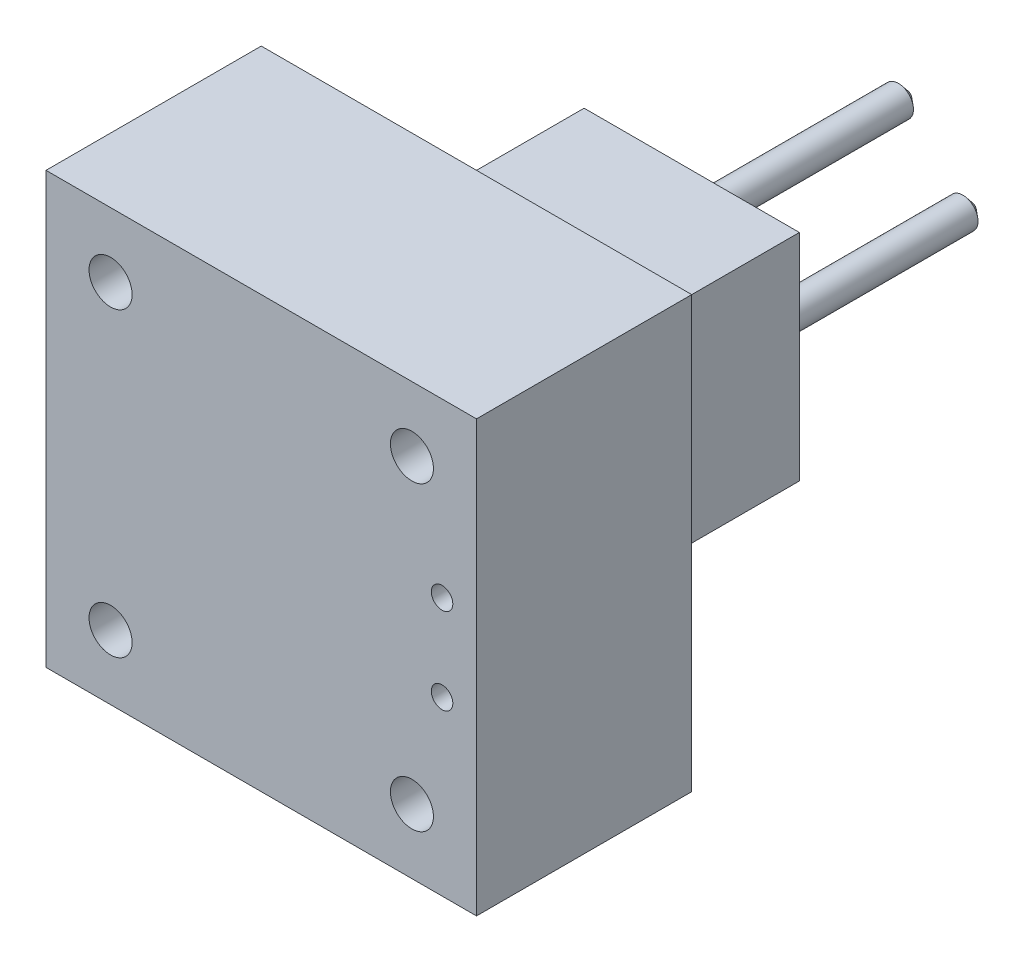
ISO-10303-21;
HEADER;
FILE_DESCRIPTION(('STEP AP214'),'2;1');
FILE_NAME('part.step','',(''),(''),'','','');
FILE_SCHEMA(('AUTOMOTIVE_DESIGN { 1 0 10303 214 1 1 1 1 }'));
ENDSEC;
DATA;
#1=APPLICATION_CONTEXT('core data for automotive mechanical design processes');
#2=APPLICATION_PROTOCOL_DEFINITION('international standard','automotive_design',2000,#1);
#3=PRODUCT_CONTEXT('',#1,'mechanical');
#4=PRODUCT('Part','Part','',(#3));
#5=PRODUCT_RELATED_PRODUCT_CATEGORY('part','',(#4));
#6=PRODUCT_DEFINITION_FORMATION('','',#4);
#7=PRODUCT_DEFINITION_CONTEXT('part definition',#1,'design');
#8=PRODUCT_DEFINITION('design','',#6,#7);
#9=PRODUCT_DEFINITION_SHAPE('','',#8);
#10=(LENGTH_UNIT() NAMED_UNIT(*) SI_UNIT(.MILLI.,.METRE.));
#11=(NAMED_UNIT(*) PLANE_ANGLE_UNIT() SI_UNIT($,.RADIAN.));
#12=(NAMED_UNIT(*) SI_UNIT($,.STERADIAN.) SOLID_ANGLE_UNIT());
#13=UNCERTAINTY_MEASURE_WITH_UNIT(LENGTH_MEASURE(1.E-05),#10,'distance_accuracy_value','');
#14=(GEOMETRIC_REPRESENTATION_CONTEXT(3) GLOBAL_UNCERTAINTY_ASSIGNED_CONTEXT((#13)) GLOBAL_UNIT_ASSIGNED_CONTEXT((#10,
#11,#12)) REPRESENTATION_CONTEXT('',''));
#15=CARTESIAN_POINT('',(0.,0.,0.));
#16=DIRECTION('',(0.,0.,1.));
#17=DIRECTION('',(1.,0.,0.));
#18=AXIS2_PLACEMENT_3D('',#15,#16,#17);
#19=CARTESIAN_POINT('',(0.,0.,0.));
#20=DIRECTION('',(0.,0.,1.));
#21=DIRECTION('',(1.,0.,0.));
#22=AXIS2_PLACEMENT_3D('',#19,#20,#21);
#23=PLANE('',#22);
#24=DIRECTION('',(0.,-1.,0.));
#25=VECTOR('',#24,1.);
#26=CARTESIAN_POINT('',(-46.031746031746,31.2169312169312,0.));
#27=LINE('',#26,#25);
#28=CARTESIAN_POINT('',(-46.031746031746,31.2169312169312,0.));
#29=VERTEX_POINT('',#28);
#30=CARTESIAN_POINT('',(-46.031746031746,-68.7830687830688,0.));
#31=VERTEX_POINT('',#30);
#32=EDGE_CURVE('E183',#29,#31,#27,.T.);
#33=ORIENTED_EDGE('',*,*,#32,.F.);
#34=DIRECTION('',(-1.,0.,0.));
#35=VECTOR('',#34,1.);
#36=CARTESIAN_POINT('',(-46.031746031746,31.2169312169312,0.));
#37=LINE('',#36,#35);
#38=CARTESIAN_POINT('',(53.968253968254,31.2169312169312,0.));
#39=VERTEX_POINT('',#38);
#40=EDGE_CURVE('E192',#39,#29,#37,.T.);
#41=ORIENTED_EDGE('',*,*,#40,.F.);
#42=DIRECTION('',(0.,1.,0.));
#43=VECTOR('',#42,1.);
#44=CARTESIAN_POINT('',(53.968253968254,31.2169312169312,0.));
#45=LINE('',#44,#43);
#46=CARTESIAN_POINT('',(53.968253968254,-68.7830687830688,0.));
#47=VERTEX_POINT('',#46);
#48=EDGE_CURVE('E208',#47,#39,#45,.T.);
#49=ORIENTED_EDGE('',*,*,#48,.F.);
#50=DIRECTION('',(1.,0.,0.));
#51=VECTOR('',#50,1.);
#52=CARTESIAN_POINT('',(-46.031746031746,-68.7830687830688,0.));
#53=LINE('',#52,#51);
#54=EDGE_CURVE('E205',#31,#47,#53,.T.);
#55=ORIENTED_EDGE('',*,*,#54,.F.);
#56=EDGE_LOOP('',(#33,#41,#49,#55));
#57=FACE_BOUND('',#56,.T.);
#58=CARTESIAN_POINT('',(38.968253968254,16.2169312169312,0.));
#59=DIRECTION('',(0.,0.,-1.));
#60=DIRECTION('',(-1.,0.,0.));
#61=AXIS2_PLACEMENT_3D('',#58,#59,#60);
#62=CIRCLE('',#61,5.);
#63=CARTESIAN_POINT('',(33.968253968254,16.2169312169312,0.));
#64=VERTEX_POINT('',#63);
#65=EDGE_CURVE('E167',#64,#64,#62,.T.);
#66=ORIENTED_EDGE('',*,*,#65,.F.);
#67=EDGE_LOOP('',(#66));
#68=FACE_BOUND('',#67,.T.);
#69=CARTESIAN_POINT('',(-31.031746031746,-53.7830687830688,0.));
#70=DIRECTION('',(0.,0.,-1.));
#71=DIRECTION('',(-1.,0.,0.));
#72=AXIS2_PLACEMENT_3D('',#69,#70,#71);
#73=CIRCLE('',#72,5.);
#74=CARTESIAN_POINT('',(-36.031746031746,-53.7830687830688,0.));
#75=VERTEX_POINT('',#74);
#76=EDGE_CURVE('E147',#75,#75,#73,.T.);
#77=ORIENTED_EDGE('',*,*,#76,.F.);
#78=EDGE_LOOP('',(#77));
#79=FACE_BOUND('',#78,.T.);
#80=CARTESIAN_POINT('',(38.968253968254,-53.7830687830688,0.));
#81=DIRECTION('',(0.,0.,-1.));
#82=DIRECTION('',(-1.,0.,0.));
#83=AXIS2_PLACEMENT_3D('',#80,#81,#82);
#84=CIRCLE('',#83,5.);
#85=CARTESIAN_POINT('',(33.968253968254,-53.7830687830688,0.));
#86=VERTEX_POINT('',#85);
#87=EDGE_CURVE('E159',#86,#86,#84,.T.);
#88=ORIENTED_EDGE('',*,*,#87,.F.);
#89=EDGE_LOOP('',(#88));
#90=FACE_BOUND('',#89,.T.);
#91=CARTESIAN_POINT('',(-31.031746031746,16.2169312169312,0.));
#92=DIRECTION('',(0.,0.,-1.));
#93=DIRECTION('',(-1.,0.,0.));
#94=AXIS2_PLACEMENT_3D('',#91,#92,#93);
#95=CIRCLE('',#94,5.);
#96=CARTESIAN_POINT('',(-36.031746031746,16.2169312169312,0.));
#97=VERTEX_POINT('',#96);
#98=EDGE_CURVE('E168',#97,#97,#95,.T.);
#99=ORIENTED_EDGE('',*,*,#98,.F.);
#100=EDGE_LOOP('',(#99));
#101=FACE_BOUND('',#100,.T.);
#102=CARTESIAN_POINT('',(45.968253968254,-28.7830687830688,0.));
#103=DIRECTION('',(0.,0.,-1.));
#104=DIRECTION('',(-1.,0.,0.));
#105=AXIS2_PLACEMENT_3D('',#102,#103,#104);
#106=CIRCLE('',#105,2.5);
#107=CARTESIAN_POINT('',(43.468253968254,-28.7830687830688,0.));
#108=VERTEX_POINT('',#107);
#109=EDGE_CURVE('E132',#108,#108,#106,.T.);
#110=ORIENTED_EDGE('',*,*,#109,.F.);
#111=EDGE_LOOP('',(#110));
#112=FACE_BOUND('',#111,.T.);
#113=CARTESIAN_POINT('',(45.968253968254,-8.78306878306878,0.));
#114=DIRECTION('',(0.,0.,-1.));
#115=DIRECTION('',(-1.,0.,0.));
#116=AXIS2_PLACEMENT_3D('',#113,#114,#115);
#117=CIRCLE('',#116,2.5);
#118=CARTESIAN_POINT('',(43.468253968254,-8.78306878306878,0.));
#119=VERTEX_POINT('',#118);
#120=EDGE_CURVE('E148',#119,#119,#117,.T.);
#121=ORIENTED_EDGE('',*,*,#120,.F.);
#122=EDGE_LOOP('',(#121));
#123=FACE_BOUND('',#122,.T.);
#124=DIRECTION('',(0.,-1.,0.));
#125=VECTOR('',#124,1.);
#126=CARTESIAN_POINT('',(28.968253968254,6.21693121693122,0.));
#127=LINE('',#126,#125);
#128=CARTESIAN_POINT('',(28.968253968254,6.21693121693122,0.));
#129=VERTEX_POINT('',#128);
#130=CARTESIAN_POINT('',(28.968253968254,-43.7830687830688,0.));
#131=VERTEX_POINT('',#130);
#132=EDGE_CURVE('E130',#129,#131,#127,.T.);
#133=ORIENTED_EDGE('',*,*,#132,.F.);
#134=DIRECTION('',(1.,0.,0.));
#135=VECTOR('',#134,1.);
#136=CARTESIAN_POINT('',(28.968253968254,6.21693121693122,0.));
#137=LINE('',#136,#135);
#138=CARTESIAN_POINT('',(-21.031746031746,6.21693121693122,0.));
#139=VERTEX_POINT('',#138);
#140=EDGE_CURVE('E127',#139,#129,#137,.T.);
#141=ORIENTED_EDGE('',*,*,#140,.F.);
#142=DIRECTION('',(0.,1.,0.));
#143=VECTOR('',#142,1.);
#144=CARTESIAN_POINT('',(-21.031746031746,6.21693121693122,0.));
#145=LINE('',#144,#143);
#146=CARTESIAN_POINT('',(-21.031746031746,-43.7830687830688,0.));
#147=VERTEX_POINT('',#146);
#148=EDGE_CURVE('E63',#147,#139,#145,.T.);
#149=ORIENTED_EDGE('',*,*,#148,.F.);
#150=DIRECTION('',(-1.,0.,0.));
#151=VECTOR('',#150,1.);
#152=CARTESIAN_POINT('',(28.968253968254,-43.7830687830688,0.));
#153=LINE('',#152,#151);
#154=EDGE_CURVE('E58',#131,#147,#153,.T.);
#155=ORIENTED_EDGE('',*,*,#154,.F.);
#156=EDGE_LOOP('',(#133,#141,#149,#155));
#157=FACE_BOUND('',#156,.T.);
#158=ADVANCED_FACE('F41',(#57,#68,#79,#90,#101,#112,#123,#157),#23,.F.);
#159=CARTESIAN_POINT('',(-46.031746031746,31.2169312169312,50.));
#160=DIRECTION('',(1.,0.,0.));
#161=DIRECTION('',(0.,1.,0.));
#162=AXIS2_PLACEMENT_3D('',#159,#160,#161);
#163=PLANE('',#162);
#164=ORIENTED_EDGE('',*,*,#32,.T.);
#165=DIRECTION('',(0.,0.,-1.));
#166=VECTOR('',#165,1.);
#167=CARTESIAN_POINT('',(-46.031746031746,-68.7830687830688,50.));
#168=LINE('',#167,#166);
#169=CARTESIAN_POINT('',(-46.031746031746,-68.7830687830688,50.));
#170=VERTEX_POINT('',#169);
#171=EDGE_CURVE('E224',#170,#31,#168,.T.);
#172=ORIENTED_EDGE('',*,*,#171,.F.);
#173=DIRECTION('',(0.,-1.,0.));
#174=VECTOR('',#173,1.);
#175=CARTESIAN_POINT('',(-46.031746031746,31.2169312169312,50.));
#176=LINE('',#175,#174);
#177=CARTESIAN_POINT('',(-46.031746031746,31.2169312169312,50.));
#178=VERTEX_POINT('',#177);
#179=EDGE_CURVE('E187',#178,#170,#176,.T.);
#180=ORIENTED_EDGE('',*,*,#179,.F.);
#181=DIRECTION('',(0.,0.,-1.));
#182=VECTOR('',#181,1.);
#183=CARTESIAN_POINT('',(-46.031746031746,31.2169312169312,50.));
#184=LINE('',#183,#182);
#185=EDGE_CURVE('E201',#178,#29,#184,.T.);
#186=ORIENTED_EDGE('',*,*,#185,.T.);
#187=EDGE_LOOP('',(#164,#172,#180,#186));
#188=FACE_BOUND('',#187,.T.);
#189=ADVANCED_FACE('F283',(#188),#163,.F.);
#190=CARTESIAN_POINT('',(-46.031746031746,-68.7830687830688,50.));
#191=DIRECTION('',(0.,1.,0.));
#192=DIRECTION('',(0.,0.,1.));
#193=AXIS2_PLACEMENT_3D('',#190,#191,#192);
#194=PLANE('',#193);
#195=ORIENTED_EDGE('',*,*,#54,.T.);
#196=DIRECTION('',(0.,0.,-1.));
#197=VECTOR('',#196,1.);
#198=CARTESIAN_POINT('',(53.968253968254,-68.7830687830688,50.));
#199=LINE('',#198,#197);
#200=CARTESIAN_POINT('',(53.968253968254,-68.7830687830688,50.));
#201=VERTEX_POINT('',#200);
#202=EDGE_CURVE('E220',#201,#47,#199,.T.);
#203=ORIENTED_EDGE('',*,*,#202,.F.);
#204=DIRECTION('',(1.,0.,0.));
#205=VECTOR('',#204,1.);
#206=CARTESIAN_POINT('',(-46.031746031746,-68.7830687830688,50.));
#207=LINE('',#206,#205);
#208=EDGE_CURVE('E191',#170,#201,#207,.T.);
#209=ORIENTED_EDGE('',*,*,#208,.F.);
#210=ORIENTED_EDGE('',*,*,#171,.T.);
#211=EDGE_LOOP('',(#195,#203,#209,#210));
#212=FACE_BOUND('',#211,.T.);
#213=ADVANCED_FACE('F289',(#212),#194,.F.);
#214=CARTESIAN_POINT('',(53.968253968254,31.2169312169312,50.));
#215=DIRECTION('',(-1.,0.,0.));
#216=DIRECTION('',(0.,-1.,0.));
#217=AXIS2_PLACEMENT_3D('',#214,#215,#216);
#218=PLANE('',#217);
#219=ORIENTED_EDGE('',*,*,#48,.T.);
#220=DIRECTION('',(0.,0.,-1.));
#221=VECTOR('',#220,1.);
#222=CARTESIAN_POINT('',(53.968253968254,31.2169312169312,50.));
#223=LINE('',#222,#221);
#224=CARTESIAN_POINT('',(53.968253968254,31.2169312169312,50.));
#225=VERTEX_POINT('',#224);
#226=EDGE_CURVE('E216',#225,#39,#223,.T.);
#227=ORIENTED_EDGE('',*,*,#226,.F.);
#228=DIRECTION('',(0.,1.,0.));
#229=VECTOR('',#228,1.);
#230=CARTESIAN_POINT('',(53.968253968254,31.2169312169312,50.));
#231=LINE('',#230,#229);
#232=EDGE_CURVE('E195',#201,#225,#231,.T.);
#233=ORIENTED_EDGE('',*,*,#232,.F.);
#234=ORIENTED_EDGE('',*,*,#202,.T.);
#235=EDGE_LOOP('',(#219,#227,#233,#234));
#236=FACE_BOUND('',#235,.T.);
#237=ADVANCED_FACE('F301',(#236),#218,.F.);
#238=CARTESIAN_POINT('',(-46.031746031746,31.2169312169312,50.));
#239=DIRECTION('',(0.,-1.,0.));
#240=DIRECTION('',(0.,0.,-1.));
#241=AXIS2_PLACEMENT_3D('',#238,#239,#240);
#242=PLANE('',#241);
#243=ORIENTED_EDGE('',*,*,#40,.T.);
#244=ORIENTED_EDGE('',*,*,#185,.F.);
#245=DIRECTION('',(-1.,0.,0.));
#246=VECTOR('',#245,1.);
#247=CARTESIAN_POINT('',(-46.031746031746,31.2169312169312,50.));
#248=LINE('',#247,#246);
#249=EDGE_CURVE('E198',#225,#178,#248,.T.);
#250=ORIENTED_EDGE('',*,*,#249,.F.);
#251=ORIENTED_EDGE('',*,*,#226,.T.);
#252=EDGE_LOOP('',(#243,#244,#250,#251));
#253=FACE_BOUND('',#252,.T.);
#254=ADVANCED_FACE('F298',(#253),#242,.F.);
#255=CARTESIAN_POINT('',(0.,0.,50.));
#256=DIRECTION('',(0.,0.,1.));
#257=DIRECTION('',(1.,0.,0.));
#258=AXIS2_PLACEMENT_3D('',#255,#256,#257);
#259=PLANE('',#258);
#260=CARTESIAN_POINT('',(45.968253968254,-8.78306878306878,50.));
#261=DIRECTION('',(0.,0.,-1.));
#262=DIRECTION('',(-1.,0.,0.));
#263=AXIS2_PLACEMENT_3D('',#260,#261,#262);
#264=CIRCLE('',#263,2.5);
#265=CARTESIAN_POINT('',(43.468253968254,-8.78306878306878,50.));
#266=VERTEX_POINT('',#265);
#267=EDGE_CURVE('E143',#266,#266,#264,.T.);
#268=ORIENTED_EDGE('',*,*,#267,.T.);
#269=EDGE_LOOP('',(#268));
#270=FACE_BOUND('',#269,.T.);
#271=CARTESIAN_POINT('',(45.968253968254,-28.7830687830688,50.));
#272=DIRECTION('',(0.,0.,-1.));
#273=DIRECTION('',(-1.,0.,0.));
#274=AXIS2_PLACEMENT_3D('',#271,#272,#273);
#275=CIRCLE('',#274,2.5);
#276=CARTESIAN_POINT('',(43.468253968254,-28.7830687830688,50.));
#277=VERTEX_POINT('',#276);
#278=EDGE_CURVE('E137',#277,#277,#275,.T.);
#279=ORIENTED_EDGE('',*,*,#278,.T.);
#280=EDGE_LOOP('',(#279));
#281=FACE_BOUND('',#280,.T.);
#282=CARTESIAN_POINT('',(-31.031746031746,16.2169312169312,50.));
#283=DIRECTION('',(0.,0.,-1.));
#284=DIRECTION('',(-1.,0.,0.));
#285=AXIS2_PLACEMENT_3D('',#282,#283,#284);
#286=CIRCLE('',#285,5.);
#287=CARTESIAN_POINT('',(-36.031746031746,16.2169312169312,50.));
#288=VERTEX_POINT('',#287);
#289=EDGE_CURVE('E163',#288,#288,#286,.T.);
#290=ORIENTED_EDGE('',*,*,#289,.T.);
#291=EDGE_LOOP('',(#290));
#292=FACE_BOUND('',#291,.T.);
#293=CARTESIAN_POINT('',(38.968253968254,-53.7830687830688,50.));
#294=DIRECTION('',(0.,0.,-1.));
#295=DIRECTION('',(-1.,0.,0.));
#296=AXIS2_PLACEMENT_3D('',#293,#294,#295);
#297=CIRCLE('',#296,5.);
#298=CARTESIAN_POINT('',(33.968253968254,-53.7830687830688,50.));
#299=VERTEX_POINT('',#298);
#300=EDGE_CURVE('E172',#299,#299,#297,.T.);
#301=ORIENTED_EDGE('',*,*,#300,.T.);
#302=EDGE_LOOP('',(#301));
#303=FACE_BOUND('',#302,.T.);
#304=CARTESIAN_POINT('',(-31.031746031746,-53.7830687830688,50.));
#305=DIRECTION('',(0.,0.,-1.));
#306=DIRECTION('',(-1.,0.,0.));
#307=AXIS2_PLACEMENT_3D('',#304,#305,#306);
#308=CIRCLE('',#307,5.);
#309=CARTESIAN_POINT('',(-36.031746031746,-53.7830687830688,50.));
#310=VERTEX_POINT('',#309);
#311=EDGE_CURVE('E155',#310,#310,#308,.T.);
#312=ORIENTED_EDGE('',*,*,#311,.T.);
#313=EDGE_LOOP('',(#312));
#314=FACE_BOUND('',#313,.T.);
#315=CARTESIAN_POINT('',(38.968253968254,16.2169312169312,50.));
#316=DIRECTION('',(0.,0.,-1.));
#317=DIRECTION('',(-1.,0.,0.));
#318=AXIS2_PLACEMENT_3D('',#315,#316,#317);
#319=CIRCLE('',#318,5.);
#320=CARTESIAN_POINT('',(33.968253968254,16.2169312169312,50.));
#321=VERTEX_POINT('',#320);
#322=EDGE_CURVE('E179',#321,#321,#319,.T.);
#323=ORIENTED_EDGE('',*,*,#322,.T.);
#324=EDGE_LOOP('',(#323));
#325=FACE_BOUND('',#324,.T.);
#326=ORIENTED_EDGE('',*,*,#179,.T.);
#327=ORIENTED_EDGE('',*,*,#208,.T.);
#328=ORIENTED_EDGE('',*,*,#232,.T.);
#329=ORIENTED_EDGE('',*,*,#249,.T.);
#330=EDGE_LOOP('',(#326,#327,#328,#329));
#331=FACE_BOUND('',#330,.T.);
#332=ADVANCED_FACE('F296',(#270,#281,#292,#303,#314,#325,#331),#259,.T.);
#333=CARTESIAN_POINT('',(38.968253968254,16.2169312169312,50.));
#334=DIRECTION('',(0.,0.,-1.));
#335=DIRECTION('',(-1.,0.,0.));
#336=AXIS2_PLACEMENT_3D('',#333,#334,#335);
#337=CYLINDRICAL_SURFACE('',#336,5.);
#338=ORIENTED_EDGE('',*,*,#322,.F.);
#339=EDGE_LOOP('',(#338));
#340=FACE_BOUND('',#339,.T.);
#341=ORIENTED_EDGE('',*,*,#65,.T.);
#342=EDGE_LOOP('',(#341));
#343=FACE_BOUND('',#342,.T.);
#344=ADVANCED_FACE('F392',(#340,#343),#337,.F.);
#345=CARTESIAN_POINT('',(-31.031746031746,-53.7830687830688,50.));
#346=DIRECTION('',(0.,0.,-1.));
#347=DIRECTION('',(-1.,0.,0.));
#348=AXIS2_PLACEMENT_3D('',#345,#346,#347);
#349=CYLINDRICAL_SURFACE('',#348,5.);
#350=ORIENTED_EDGE('',*,*,#311,.F.);
#351=EDGE_LOOP('',(#350));
#352=FACE_BOUND('',#351,.T.);
#353=ORIENTED_EDGE('',*,*,#76,.T.);
#354=EDGE_LOOP('',(#353));
#355=FACE_BOUND('',#354,.T.);
#356=ADVANCED_FACE('F388',(#352,#355),#349,.F.);
#357=CARTESIAN_POINT('',(38.968253968254,-53.7830687830688,50.));
#358=DIRECTION('',(0.,0.,-1.));
#359=DIRECTION('',(-1.,0.,0.));
#360=AXIS2_PLACEMENT_3D('',#357,#358,#359);
#361=CYLINDRICAL_SURFACE('',#360,5.);
#362=ORIENTED_EDGE('',*,*,#300,.F.);
#363=EDGE_LOOP('',(#362));
#364=FACE_BOUND('',#363,.T.);
#365=ORIENTED_EDGE('',*,*,#87,.T.);
#366=EDGE_LOOP('',(#365));
#367=FACE_BOUND('',#366,.T.);
#368=ADVANCED_FACE('F391',(#364,#367),#361,.F.);
#369=CARTESIAN_POINT('',(-31.031746031746,16.2169312169312,50.));
#370=DIRECTION('',(0.,0.,-1.));
#371=DIRECTION('',(-1.,0.,0.));
#372=AXIS2_PLACEMENT_3D('',#369,#370,#371);
#373=CYLINDRICAL_SURFACE('',#372,5.);
#374=ORIENTED_EDGE('',*,*,#289,.F.);
#375=EDGE_LOOP('',(#374));
#376=FACE_BOUND('',#375,.T.);
#377=ORIENTED_EDGE('',*,*,#98,.T.);
#378=EDGE_LOOP('',(#377));
#379=FACE_BOUND('',#378,.T.);
#380=ADVANCED_FACE('F386',(#376,#379),#373,.F.);
#381=CARTESIAN_POINT('',(45.968253968254,-28.7830687830688,50.));
#382=DIRECTION('',(0.,0.,-1.));
#383=DIRECTION('',(-1.,0.,0.));
#384=AXIS2_PLACEMENT_3D('',#381,#382,#383);
#385=CYLINDRICAL_SURFACE('',#384,2.5);
#386=ORIENTED_EDGE('',*,*,#278,.F.);
#387=EDGE_LOOP('',(#386));
#388=FACE_BOUND('',#387,.T.);
#389=ORIENTED_EDGE('',*,*,#109,.T.);
#390=EDGE_LOOP('',(#389));
#391=FACE_BOUND('',#390,.T.);
#392=ADVANCED_FACE('F382',(#388,#391),#385,.F.);
#393=CARTESIAN_POINT('',(45.968253968254,-8.78306878306878,50.));
#394=DIRECTION('',(0.,0.,-1.));
#395=DIRECTION('',(-1.,0.,0.));
#396=AXIS2_PLACEMENT_3D('',#393,#394,#395);
#397=CYLINDRICAL_SURFACE('',#396,2.5);
#398=ORIENTED_EDGE('',*,*,#267,.F.);
#399=EDGE_LOOP('',(#398));
#400=FACE_BOUND('',#399,.T.);
#401=ORIENTED_EDGE('',*,*,#120,.T.);
#402=EDGE_LOOP('',(#401));
#403=FACE_BOUND('',#402,.T.);
#404=ADVANCED_FACE('F379',(#400,#403),#397,.F.);
#405=CARTESIAN_POINT('',(28.968253968254,6.21693121693122,-50.));
#406=DIRECTION('',(-1.,0.,0.));
#407=DIRECTION('',(0.,-1.,0.));
#408=AXIS2_PLACEMENT_3D('',#405,#406,#407);
#409=PLANE('',#408);
#410=ORIENTED_EDGE('',*,*,#132,.T.);
#411=DIRECTION('',(0.,0.,1.));
#412=VECTOR('',#411,1.);
#413=CARTESIAN_POINT('',(28.968253968254,-43.7830687830688,-50.));
#414=LINE('',#413,#412);
#415=CARTESIAN_POINT('',(28.968253968254,-43.7830687830688,-50.));
#416=VERTEX_POINT('',#415);
#417=EDGE_CURVE('E109',#416,#131,#414,.T.);
#418=ORIENTED_EDGE('',*,*,#417,.F.);
#419=DIRECTION('',(0.,-1.,0.));
#420=VECTOR('',#419,1.);
#421=CARTESIAN_POINT('',(28.968253968254,6.21693121693122,-50.));
#422=LINE('',#421,#420);
#423=CARTESIAN_POINT('',(28.968253968254,6.21693121693122,-50.));
#424=VERTEX_POINT('',#423);
#425=EDGE_CURVE('E117',#424,#416,#422,.T.);
#426=ORIENTED_EDGE('',*,*,#425,.F.);
#427=DIRECTION('',(0.,0.,1.));
#428=VECTOR('',#427,1.);
#429=CARTESIAN_POINT('',(28.968253968254,6.21693121693122,-50.));
#430=LINE('',#429,#428);
#431=EDGE_CURVE('E422',#424,#129,#430,.T.);
#432=ORIENTED_EDGE('',*,*,#431,.T.);
#433=EDGE_LOOP('',(#410,#418,#426,#432));
#434=FACE_BOUND('',#433,.T.);
#435=ADVANCED_FACE('F129',(#434),#409,.F.);
#436=CARTESIAN_POINT('',(28.968253968254,-43.7830687830688,-50.));
#437=DIRECTION('',(0.,1.,0.));
#438=DIRECTION('',(0.,0.,1.));
#439=AXIS2_PLACEMENT_3D('',#436,#437,#438);
#440=PLANE('',#439);
#441=ORIENTED_EDGE('',*,*,#154,.T.);
#442=DIRECTION('',(0.,0.,1.));
#443=VECTOR('',#442,1.);
#444=CARTESIAN_POINT('',(-21.031746031746,-43.7830687830688,-50.));
#445=LINE('',#444,#443);
#446=CARTESIAN_POINT('',(-21.031746031746,-43.7830687830688,-50.));
#447=VERTEX_POINT('',#446);
#448=EDGE_CURVE('E112',#447,#147,#445,.T.);
#449=ORIENTED_EDGE('',*,*,#448,.F.);
#450=DIRECTION('',(-1.,0.,0.));
#451=VECTOR('',#450,1.);
#452=CARTESIAN_POINT('',(28.968253968254,-43.7830687830688,-50.));
#453=LINE('',#452,#451);
#454=EDGE_CURVE('E105',#416,#447,#453,.T.);
#455=ORIENTED_EDGE('',*,*,#454,.F.);
#456=ORIENTED_EDGE('',*,*,#417,.T.);
#457=EDGE_LOOP('',(#441,#449,#455,#456));
#458=FACE_BOUND('',#457,.T.);
#459=ADVANCED_FACE('F107',(#458),#440,.F.);
#460=CARTESIAN_POINT('',(-21.031746031746,6.21693121693122,-50.));
#461=DIRECTION('',(1.,0.,0.));
#462=DIRECTION('',(0.,1.,0.));
#463=AXIS2_PLACEMENT_3D('',#460,#461,#462);
#464=PLANE('',#463);
#465=ORIENTED_EDGE('',*,*,#148,.T.);
#466=DIRECTION('',(0.,0.,1.));
#467=VECTOR('',#466,1.);
#468=CARTESIAN_POINT('',(-21.031746031746,6.21693121693122,-50.));
#469=LINE('',#468,#467);
#470=CARTESIAN_POINT('',(-21.031746031746,6.21693121693122,-50.));
#471=VERTEX_POINT('',#470);
#472=EDGE_CURVE('E139',#471,#139,#469,.T.);
#473=ORIENTED_EDGE('',*,*,#472,.F.);
#474=DIRECTION('',(0.,1.,0.));
#475=VECTOR('',#474,1.);
#476=CARTESIAN_POINT('',(-21.031746031746,6.21693121693122,-50.));
#477=LINE('',#476,#475);
#478=EDGE_CURVE('E116',#447,#471,#477,.T.);
#479=ORIENTED_EDGE('',*,*,#478,.F.);
#480=ORIENTED_EDGE('',*,*,#448,.T.);
#481=EDGE_LOOP('',(#465,#473,#479,#480));
#482=FACE_BOUND('',#481,.T.);
#483=ADVANCED_FACE('F370',(#482),#464,.F.);
#484=CARTESIAN_POINT('',(28.968253968254,6.21693121693122,-50.));
#485=DIRECTION('',(0.,-1.,0.));
#486=DIRECTION('',(0.,0.,-1.));
#487=AXIS2_PLACEMENT_3D('',#484,#485,#486);
#488=PLANE('',#487);
#489=ORIENTED_EDGE('',*,*,#140,.T.);
#490=ORIENTED_EDGE('',*,*,#431,.F.);
#491=DIRECTION('',(1.,0.,0.));
#492=VECTOR('',#491,1.);
#493=CARTESIAN_POINT('',(28.968253968254,6.21693121693122,-50.));
#494=LINE('',#493,#492);
#495=EDGE_CURVE('E122',#471,#424,#494,.T.);
#496=ORIENTED_EDGE('',*,*,#495,.F.);
#497=ORIENTED_EDGE('',*,*,#472,.T.);
#498=EDGE_LOOP('',(#489,#490,#496,#497));
#499=FACE_BOUND('',#498,.T.);
#500=ADVANCED_FACE('F366',(#499),#488,.F.);
#501=CARTESIAN_POINT('',(0.,0.,-50.));
#502=DIRECTION('',(0.,0.,-1.));
#503=DIRECTION('',(-1.,0.,0.));
#504=AXIS2_PLACEMENT_3D('',#501,#502,#503);
#505=PLANE('',#504);
#506=CARTESIAN_POINT('',(-11.031746031746,-18.7830687830688,-50.));
#507=DIRECTION('',(0.,0.,-1.));
#508=DIRECTION('',(-1.,0.,0.));
#509=AXIS2_PLACEMENT_3D('',#506,#507,#508);
#510=CIRCLE('',#509,3.5);
#511=CARTESIAN_POINT('',(-14.531746031746,-18.7830687830688,-50.));
#512=VERTEX_POINT('',#511);
#513=EDGE_CURVE('E241',#512,#512,#510,.F.);
#514=ORIENTED_EDGE('',*,*,#513,.T.);
#515=EDGE_LOOP('',(#514));
#516=FACE_BOUND('',#515,.T.);
#517=CARTESIAN_POINT('',(3.96825396825399,-33.7830687830688,-50.));
#518=DIRECTION('',(0.,0.,-1.));
#519=DIRECTION('',(-1.,0.,0.));
#520=AXIS2_PLACEMENT_3D('',#517,#518,#519);
#521=CIRCLE('',#520,3.5);
#522=CARTESIAN_POINT('',(0.468253968253989,-33.7830687830688,-50.));
#523=VERTEX_POINT('',#522);
#524=EDGE_CURVE('E237',#523,#523,#521,.F.);
#525=ORIENTED_EDGE('',*,*,#524,.T.);
#526=EDGE_LOOP('',(#525));
#527=FACE_BOUND('',#526,.T.);
#528=CARTESIAN_POINT('',(18.968253968254,-18.7830687830688,-50.));
#529=DIRECTION('',(0.,0.,-1.));
#530=DIRECTION('',(-1.,0.,0.));
#531=AXIS2_PLACEMENT_3D('',#528,#529,#530);
#532=CIRCLE('',#531,3.5);
#533=CARTESIAN_POINT('',(15.468253968254,-18.7830687830688,-50.));
#534=VERTEX_POINT('',#533);
#535=EDGE_CURVE('E233',#534,#534,#532,.F.);
#536=ORIENTED_EDGE('',*,*,#535,.T.);
#537=EDGE_LOOP('',(#536));
#538=FACE_BOUND('',#537,.T.);
#539=CARTESIAN_POINT('',(3.96825396825399,-3.78306878306878,-50.));
#540=DIRECTION('',(0.,0.,-1.));
#541=DIRECTION('',(-1.,0.,0.));
#542=AXIS2_PLACEMENT_3D('',#539,#540,#541);
#543=CIRCLE('',#542,3.5);
#544=CARTESIAN_POINT('',(0.468253968253989,-3.78306878306878,-50.));
#545=VERTEX_POINT('',#544);
#546=EDGE_CURVE('E229',#545,#545,#543,.F.);
#547=ORIENTED_EDGE('',*,*,#546,.T.);
#548=EDGE_LOOP('',(#547));
#549=FACE_BOUND('',#548,.T.);
#550=ORIENTED_EDGE('',*,*,#425,.T.);
#551=ORIENTED_EDGE('',*,*,#454,.T.);
#552=ORIENTED_EDGE('',*,*,#478,.T.);
#553=ORIENTED_EDGE('',*,*,#495,.T.);
#554=EDGE_LOOP('',(#550,#551,#552,#553));
#555=FACE_BOUND('',#554,.T.);
#556=ADVANCED_FACE('F120',(#516,#527,#538,#549,#555),#505,.T.);
#557=CARTESIAN_POINT('',(3.96825396825399,-3.78306878306878,-100.));
#558=DIRECTION('',(0.,0.,1.));
#559=DIRECTION('',(1.,0.,0.));
#560=AXIS2_PLACEMENT_3D('',#557,#558,#559);
#561=CYLINDRICAL_SURFACE('',#560,3.5);
#562=CARTESIAN_POINT('',(3.96825396825399,-3.78306878306878,-98.));
#563=DIRECTION('',(0.,0.,-1.));
#564=DIRECTION('',(-1.,0.,0.));
#565=AXIS2_PLACEMENT_3D('',#562,#563,#564);
#566=CIRCLE('',#565,3.5);
#567=CARTESIAN_POINT('',(0.468253968253989,-3.78306878306878,-98.));
#568=VERTEX_POINT('',#567);
#569=EDGE_CURVE('E248',#568,#568,#566,.F.);
#570=ORIENTED_EDGE('',*,*,#569,.T.);
#571=EDGE_LOOP('',(#570));
#572=FACE_BOUND('',#571,.T.);
#573=ORIENTED_EDGE('',*,*,#546,.F.);
#574=EDGE_LOOP('',(#573));
#575=FACE_BOUND('',#574,.T.);
#576=ADVANCED_FACE('F359',(#572,#575),#561,.T.);
#577=CARTESIAN_POINT('',(3.96825396825399,-3.78306878306878,-100.));
#578=DIRECTION('',(0.,0.,-1.));
#579=DIRECTION('',(-1.,0.,0.));
#580=AXIS2_PLACEMENT_3D('',#577,#578,#579);
#581=PLANE('',#580);
#582=CARTESIAN_POINT('',(3.96825396825399,-3.78306878306878,-100.));
#583=DIRECTION('',(0.,0.,-1.));
#584=DIRECTION('',(-1.,0.,0.));
#585=AXIS2_PLACEMENT_3D('',#582,#583,#584);
#586=CIRCLE('',#585,1.11649281481158);
#587=CARTESIAN_POINT('',(2.85176115344241,-3.78306878306878,-100.));
#588=VERTEX_POINT('',#587);
#589=EDGE_CURVE('E228',#588,#588,#586,.T.);
#590=ORIENTED_EDGE('',*,*,#589,.T.);
#591=EDGE_LOOP('',(#590));
#592=FACE_BOUND('',#591,.T.);
#593=ADVANCED_FACE('F355',(#592),#581,.T.);
#594=CARTESIAN_POINT('',(18.968253968254,-18.7830687830688,-100.));
#595=DIRECTION('',(0.,0.,1.));
#596=DIRECTION('',(1.,0.,0.));
#597=AXIS2_PLACEMENT_3D('',#594,#595,#596);
#598=CYLINDRICAL_SURFACE('',#597,3.5);
#599=CARTESIAN_POINT('',(18.968253968254,-18.7830687830688,-98.));
#600=DIRECTION('',(0.,0.,-1.));
#601=DIRECTION('',(-1.,0.,0.));
#602=AXIS2_PLACEMENT_3D('',#599,#600,#601);
#603=CIRCLE('',#602,3.5);
#604=CARTESIAN_POINT('',(15.468253968254,-18.7830687830688,-98.));
#605=VERTEX_POINT('',#604);
#606=EDGE_CURVE('E11',#605,#605,#603,.F.);
#607=ORIENTED_EDGE('',*,*,#606,.T.);
#608=EDGE_LOOP('',(#607));
#609=FACE_BOUND('',#608,.T.);
#610=ORIENTED_EDGE('',*,*,#535,.F.);
#611=EDGE_LOOP('',(#610));
#612=FACE_BOUND('',#611,.T.);
#613=ADVANCED_FACE('F352',(#609,#612),#598,.T.);
#614=CARTESIAN_POINT('',(18.968253968254,-18.7830687830688,-100.));
#615=DIRECTION('',(0.,0.,-1.));
#616=DIRECTION('',(-1.,0.,0.));
#617=AXIS2_PLACEMENT_3D('',#614,#615,#616);
#618=PLANE('',#617);
#619=CARTESIAN_POINT('',(18.968253968254,-18.7830687830688,-100.));
#620=DIRECTION('',(0.,0.,-1.));
#621=DIRECTION('',(-1.,0.,0.));
#622=AXIS2_PLACEMENT_3D('',#619,#620,#621);
#623=CIRCLE('',#622,1.11649281481155);
#624=CARTESIAN_POINT('',(17.8517611534424,-18.7830687830688,-100.));
#625=VERTEX_POINT('',#624);
#626=EDGE_CURVE('E51',#625,#625,#623,.T.);
#627=ORIENTED_EDGE('',*,*,#626,.T.);
#628=EDGE_LOOP('',(#627));
#629=FACE_BOUND('',#628,.T.);
#630=ADVANCED_FACE('F271',(#629),#618,.T.);
#631=CARTESIAN_POINT('',(3.96825396825399,-33.7830687830688,-100.));
#632=DIRECTION('',(0.,0.,1.));
#633=DIRECTION('',(1.,0.,0.));
#634=AXIS2_PLACEMENT_3D('',#631,#632,#633);
#635=CYLINDRICAL_SURFACE('',#634,3.5);
#636=CARTESIAN_POINT('',(3.96825396825399,-33.7830687830688,-98.));
#637=DIRECTION('',(0.,0.,-1.));
#638=DIRECTION('',(-1.,0.,0.));
#639=AXIS2_PLACEMENT_3D('',#636,#637,#638);
#640=CIRCLE('',#639,3.5);
#641=CARTESIAN_POINT('',(0.468253968253989,-33.7830687830688,-98.));
#642=VERTEX_POINT('',#641);
#643=EDGE_CURVE('E264',#642,#642,#640,.F.);
#644=ORIENTED_EDGE('',*,*,#643,.T.);
#645=EDGE_LOOP('',(#644));
#646=FACE_BOUND('',#645,.T.);
#647=ORIENTED_EDGE('',*,*,#524,.F.);
#648=EDGE_LOOP('',(#647));
#649=FACE_BOUND('',#648,.T.);
#650=ADVANCED_FACE('F345',(#646,#649),#635,.T.);
#651=CARTESIAN_POINT('',(3.96825396825399,-33.7830687830688,-100.));
#652=DIRECTION('',(0.,0.,-1.));
#653=DIRECTION('',(-1.,0.,0.));
#654=AXIS2_PLACEMENT_3D('',#651,#652,#653);
#655=PLANE('',#654);
#656=CARTESIAN_POINT('',(3.96825396825399,-33.7830687830688,-100.));
#657=DIRECTION('',(0.,0.,-1.));
#658=DIRECTION('',(-1.,0.,0.));
#659=AXIS2_PLACEMENT_3D('',#656,#657,#658);
#660=CIRCLE('',#659,1.11649281481158);
#661=CARTESIAN_POINT('',(2.85176115344241,-33.7830687830688,-100.));
#662=VERTEX_POINT('',#661);
#663=EDGE_CURVE('E260',#662,#662,#660,.T.);
#664=ORIENTED_EDGE('',*,*,#663,.T.);
#665=EDGE_LOOP('',(#664));
#666=FACE_BOUND('',#665,.T.);
#667=ADVANCED_FACE('F339',(#666),#655,.T.);
#668=CARTESIAN_POINT('',(-11.031746031746,-18.7830687830688,-100.));
#669=DIRECTION('',(0.,0.,1.));
#670=DIRECTION('',(1.,0.,0.));
#671=AXIS2_PLACEMENT_3D('',#668,#669,#670);
#672=CYLINDRICAL_SURFACE('',#671,3.5);
#673=CARTESIAN_POINT('',(-11.031746031746,-18.7830687830688,-98.));
#674=DIRECTION('',(0.,0.,-1.));
#675=DIRECTION('',(-1.,0.,0.));
#676=AXIS2_PLACEMENT_3D('',#673,#674,#675);
#677=CIRCLE('',#676,3.5);
#678=CARTESIAN_POINT('',(-14.531746031746,-18.7830687830688,-98.));
#679=VERTEX_POINT('',#678);
#680=EDGE_CURVE('E256',#679,#679,#677,.F.);
#681=ORIENTED_EDGE('',*,*,#680,.T.);
#682=EDGE_LOOP('',(#681));
#683=FACE_BOUND('',#682,.T.);
#684=ORIENTED_EDGE('',*,*,#513,.F.);
#685=EDGE_LOOP('',(#684));
#686=FACE_BOUND('',#685,.T.);
#687=ADVANCED_FACE('F334',(#683,#686),#672,.T.);
#688=CARTESIAN_POINT('',(-11.031746031746,-18.7830687830688,-100.));
#689=DIRECTION('',(0.,0.,-1.));
#690=DIRECTION('',(-1.,0.,0.));
#691=AXIS2_PLACEMENT_3D('',#688,#689,#690);
#692=PLANE('',#691);
#693=CARTESIAN_POINT('',(-11.031746031746,-18.7830687830688,-100.));
#694=DIRECTION('',(0.,0.,-1.));
#695=DIRECTION('',(-1.,0.,0.));
#696=AXIS2_PLACEMENT_3D('',#693,#694,#695);
#697=CIRCLE('',#696,1.11649281481155);
#698=CARTESIAN_POINT('',(-12.1482388465576,-18.7830687830688,-100.));
#699=VERTEX_POINT('',#698);
#700=EDGE_CURVE('E252',#699,#699,#697,.T.);
#701=ORIENTED_EDGE('',*,*,#700,.T.);
#702=EDGE_LOOP('',(#701));
#703=FACE_BOUND('',#702,.T.);
#704=ADVANCED_FACE('F316',(#703),#692,.T.);
#705=CARTESIAN_POINT('',(3.96825396825399,-3.78306878306878,-100.));
#706=DIRECTION('',(0.,0.,1.));
#707=DIRECTION('',(1.,0.,0.));
#708=AXIS2_PLACEMENT_3D('',#705,#706,#707);
#709=CONICAL_SURFACE('',#708,1.11649281481158,0.872664625997162);
#710=ORIENTED_EDGE('',*,*,#569,.F.);
#711=EDGE_LOOP('',(#710));
#712=FACE_BOUND('',#711,.T.);
#713=ORIENTED_EDGE('',*,*,#589,.F.);
#714=EDGE_LOOP('',(#713));
#715=FACE_BOUND('',#714,.T.);
#716=ADVANCED_FACE('F310',(#712,#715),#709,.T.);
#717=CARTESIAN_POINT('',(-11.031746031746,-18.7830687830688,-100.));
#718=DIRECTION('',(0.,0.,1.));
#719=DIRECTION('',(1.,0.,0.));
#720=AXIS2_PLACEMENT_3D('',#717,#718,#719);
#721=CONICAL_SURFACE('',#720,1.11649281481155,0.872664625997167);
#722=ORIENTED_EDGE('',*,*,#680,.F.);
#723=EDGE_LOOP('',(#722));
#724=FACE_BOUND('',#723,.T.);
#725=ORIENTED_EDGE('',*,*,#700,.F.);
#726=EDGE_LOOP('',(#725));
#727=FACE_BOUND('',#726,.T.);
#728=ADVANCED_FACE('F279',(#724,#727),#721,.T.);
#729=CARTESIAN_POINT('',(3.96825396825399,-33.7830687830688,-100.));
#730=DIRECTION('',(0.,0.,1.));
#731=DIRECTION('',(1.,0.,0.));
#732=AXIS2_PLACEMENT_3D('',#729,#730,#731);
#733=CONICAL_SURFACE('',#732,1.11649281481158,0.872664625997162);
#734=ORIENTED_EDGE('',*,*,#643,.F.);
#735=EDGE_LOOP('',(#734));
#736=FACE_BOUND('',#735,.T.);
#737=ORIENTED_EDGE('',*,*,#663,.F.);
#738=EDGE_LOOP('',(#737));
#739=FACE_BOUND('',#738,.T.);
#740=ADVANCED_FACE('F274',(#736,#739),#733,.T.);
#741=CARTESIAN_POINT('',(18.968253968254,-18.7830687830688,-100.));
#742=DIRECTION('',(0.,0.,1.));
#743=DIRECTION('',(1.,0.,0.));
#744=AXIS2_PLACEMENT_3D('',#741,#742,#743);
#745=CONICAL_SURFACE('',#744,1.11649281481155,0.872664625997167);
#746=ORIENTED_EDGE('',*,*,#606,.F.);
#747=EDGE_LOOP('',(#746));
#748=FACE_BOUND('',#747,.T.);
#749=ORIENTED_EDGE('',*,*,#626,.F.);
#750=EDGE_LOOP('',(#749));
#751=FACE_BOUND('',#750,.T.);
#752=ADVANCED_FACE('F44',(#748,#751),#745,.T.);
#753=CLOSED_SHELL('',(#158,#189,#213,#237,#254,#332,#344,#356,#368,#380,#392,#404,#435,#459,
#483,#500,#556,#576,#593,#613,#630,#650,#667,#687,#704,#716,#728,#740,#752));
#754=MANIFOLD_SOLID_BREP('B2',#753);
#755=ADVANCED_BREP_SHAPE_REPRESENTATION('',(#18,#754),#14);
#756=SHAPE_DEFINITION_REPRESENTATION(#9,#755);
ENDSEC;
END-ISO-10303-21;
